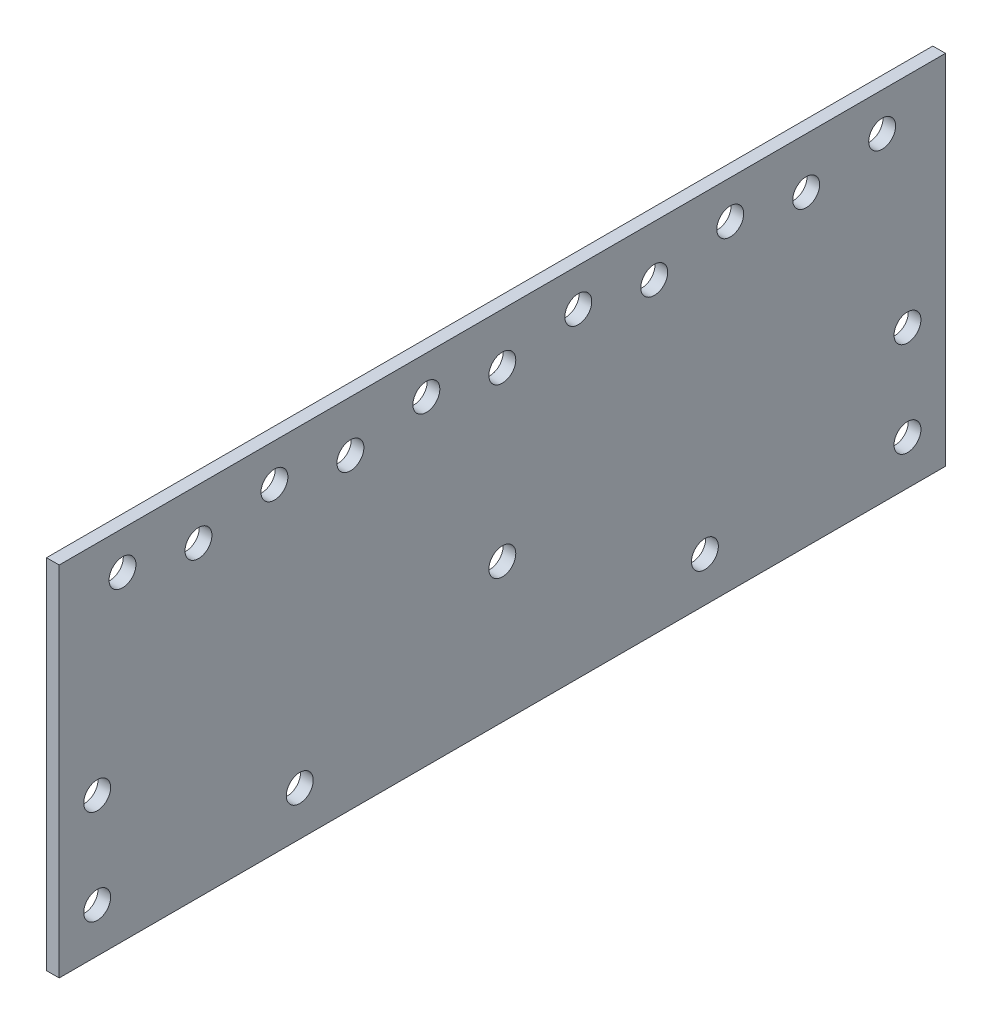
ISO-10303-21;
HEADER;
FILE_DESCRIPTION(('STEP AP214'),'2;1');
FILE_NAME('part.step','',(''),(''),'','','');
FILE_SCHEMA(('AUTOMOTIVE_DESIGN { 1 0 10303 214 1 1 1 1 }'));
ENDSEC;
DATA;
#1=APPLICATION_CONTEXT('core data for automotive mechanical design processes');
#2=APPLICATION_PROTOCOL_DEFINITION('international standard','automotive_design',2000,#1);
#3=PRODUCT_CONTEXT('',#1,'mechanical');
#4=PRODUCT('Part','Part','',(#3));
#5=PRODUCT_RELATED_PRODUCT_CATEGORY('part','',(#4));
#6=PRODUCT_DEFINITION_FORMATION('','',#4);
#7=PRODUCT_DEFINITION_CONTEXT('part definition',#1,'design');
#8=PRODUCT_DEFINITION('design','',#6,#7);
#9=PRODUCT_DEFINITION_SHAPE('','',#8);
#10=(LENGTH_UNIT() NAMED_UNIT(*) SI_UNIT(.MILLI.,.METRE.));
#11=(NAMED_UNIT(*) PLANE_ANGLE_UNIT() SI_UNIT($,.RADIAN.));
#12=(NAMED_UNIT(*) SI_UNIT($,.STERADIAN.) SOLID_ANGLE_UNIT());
#13=UNCERTAINTY_MEASURE_WITH_UNIT(LENGTH_MEASURE(1.E-05),#10,'distance_accuracy_value','');
#14=(GEOMETRIC_REPRESENTATION_CONTEXT(3) GLOBAL_UNCERTAINTY_ASSIGNED_CONTEXT((#13)) GLOBAL_UNIT_ASSIGNED_CONTEXT((#10,
#11,#12)) REPRESENTATION_CONTEXT('',''));
#15=CARTESIAN_POINT('',(0.,0.,0.));
#16=DIRECTION('',(0.,0.,1.));
#17=DIRECTION('',(1.,0.,0.));
#18=AXIS2_PLACEMENT_3D('',#15,#16,#17);
#19=CARTESIAN_POINT('',(6.35000000000013,-109.5375,222.25));
#20=DIRECTION('',(1.,0.,0.));
#21=DIRECTION('',(0.,0.,-1.));
#22=AXIS2_PLACEMENT_3D('',#19,#20,#21);
#23=PLANE('',#22);
#24=CARTESIAN_POINT('',(6.35000000000008,-39.6874999999998,-203.2));
#25=DIRECTION('',(1.,0.,0.));
#26=DIRECTION('',(0.,0.,1.));
#27=AXIS2_PLACEMENT_3D('',#24,#25,#26);
#28=CIRCLE('',#27,6.74687499999998);
#29=CARTESIAN_POINT('',(6.35000000000008,-39.6874999999998,-196.453125));
#30=VERTEX_POINT('',#29);
#31=EDGE_CURVE('E155',#30,#30,#28,.T.);
#32=ORIENTED_EDGE('',*,*,#31,.F.);
#33=EDGE_LOOP('',(#32));
#34=FACE_BOUND('',#33,.T.);
#35=CARTESIAN_POINT('',(6.35000000000008,50.8,-38.1));
#36=DIRECTION('',(1.,0.,0.));
#37=DIRECTION('',(0.,0.,1.));
#38=AXIS2_PLACEMENT_3D('',#35,#36,#37);
#39=CIRCLE('',#38,6.746875);
#40=CARTESIAN_POINT('',(6.35000000000008,50.8,-31.353125));
#41=VERTEX_POINT('',#40);
#42=EDGE_CURVE('E169',#41,#41,#39,.T.);
#43=ORIENTED_EDGE('',*,*,#42,.F.);
#44=EDGE_LOOP('',(#43));
#45=FACE_BOUND('',#44,.T.);
#46=CARTESIAN_POINT('',(6.35000000000008,50.7999999999998,-114.3));
#47=DIRECTION('',(1.,0.,0.));
#48=DIRECTION('',(0.,0.,1.));
#49=AXIS2_PLACEMENT_3D('',#46,#47,#48);
#50=CIRCLE('',#49,6.74687500000001);
#51=CARTESIAN_POINT('',(6.35000000000008,50.7999999999998,-107.553125));
#52=VERTEX_POINT('',#51);
#53=EDGE_CURVE('E179',#52,#52,#50,.T.);
#54=ORIENTED_EDGE('',*,*,#53,.F.);
#55=EDGE_LOOP('',(#54));
#56=FACE_BOUND('',#55,.T.);
#57=CARTESIAN_POINT('',(6.35000000000019,50.7999999999999,-190.5));
#58=DIRECTION('',(1.,0.,0.));
#59=DIRECTION('',(0.,0.,1.));
#60=AXIS2_PLACEMENT_3D('',#57,#58,#59);
#61=CIRCLE('',#60,6.74687499999998);
#62=CARTESIAN_POINT('',(6.35000000000019,50.7999999999999,-183.753125));
#63=VERTEX_POINT('',#62);
#64=EDGE_CURVE('E189',#63,#63,#61,.T.);
#65=ORIENTED_EDGE('',*,*,#64,.F.);
#66=EDGE_LOOP('',(#65));
#67=FACE_BOUND('',#66,.T.);
#68=CARTESIAN_POINT('',(6.34999999999986,-87.3124999999998,-203.199999999999));
#69=DIRECTION('',(1.,0.,0.));
#70=DIRECTION('',(0.,0.,1.));
#71=AXIS2_PLACEMENT_3D('',#68,#69,#70);
#72=CIRCLE('',#71,6.74687499999998);
#73=CARTESIAN_POINT('',(6.34999999999986,-87.3124999999998,-196.453124999999));
#74=VERTEX_POINT('',#73);
#75=EDGE_CURVE('E199',#74,#74,#72,.T.);
#76=ORIENTED_EDGE('',*,*,#75,.F.);
#77=EDGE_LOOP('',(#76));
#78=FACE_BOUND('',#77,.T.);
#79=CARTESIAN_POINT('',(6.3500000000003,50.7999999999996,190.5));
#80=DIRECTION('',(1.,0.,0.));
#81=DIRECTION('',(0.,0.,-1.));
#82=AXIS2_PLACEMENT_3D('',#79,#80,#81);
#83=CIRCLE('',#82,6.74687499999998);
#84=CARTESIAN_POINT('',(6.3500000000003,50.7999999999996,183.753125));
#85=VERTEX_POINT('',#84);
#86=EDGE_CURVE('E209',#85,#85,#83,.T.);
#87=ORIENTED_EDGE('',*,*,#86,.F.);
#88=EDGE_LOOP('',(#87));
#89=FACE_BOUND('',#88,.T.);
#90=CARTESIAN_POINT('',(6.35000000000008,50.7999999999999,114.3));
#91=DIRECTION('',(1.,0.,0.));
#92=DIRECTION('',(0.,0.,-1.));
#93=AXIS2_PLACEMENT_3D('',#90,#91,#92);
#94=CIRCLE('',#93,6.74687500000001);
#95=CARTESIAN_POINT('',(6.35000000000008,50.7999999999999,107.553125));
#96=VERTEX_POINT('',#95);
#97=EDGE_CURVE('E219',#96,#96,#94,.T.);
#98=ORIENTED_EDGE('',*,*,#97,.F.);
#99=EDGE_LOOP('',(#98));
#100=FACE_BOUND('',#99,.T.);
#101=CARTESIAN_POINT('',(6.35000000000019,50.7999999999997,38.1));
#102=DIRECTION('',(1.,0.,0.));
#103=DIRECTION('',(0.,0.,-1.));
#104=AXIS2_PLACEMENT_3D('',#101,#102,#103);
#105=CIRCLE('',#104,6.746875);
#106=CARTESIAN_POINT('',(6.35000000000019,50.7999999999997,31.353125));
#107=VERTEX_POINT('',#106);
#108=EDGE_CURVE('E229',#107,#107,#105,.T.);
#109=ORIENTED_EDGE('',*,*,#108,.F.);
#110=EDGE_LOOP('',(#109));
#111=FACE_BOUND('',#110,.T.);
#112=CARTESIAN_POINT('',(6.35000000000008,-87.3125000000003,203.2));
#113=DIRECTION('',(1.,0.,0.));
#114=DIRECTION('',(0.,0.,-1.));
#115=AXIS2_PLACEMENT_3D('',#112,#113,#114);
#116=CIRCLE('',#115,6.74687499999998);
#117=CARTESIAN_POINT('',(6.35000000000008,-87.3125000000003,196.453125));
#118=VERTEX_POINT('',#117);
#119=EDGE_CURVE('E89',#118,#118,#116,.T.);
#120=ORIENTED_EDGE('',*,*,#119,.F.);
#121=EDGE_LOOP('',(#120));
#122=FACE_BOUND('',#121,.T.);
#123=DIRECTION('',(0.,0.,-1.));
#124=VECTOR('',#123,1.);
#125=CARTESIAN_POINT('',(6.35000000000013,-109.5375,222.25));
#126=LINE('',#125,#124);
#127=CARTESIAN_POINT('',(6.35000000000013,-109.5375,222.25));
#128=VERTEX_POINT('',#127);
#129=CARTESIAN_POINT('',(6.35000000000008,-109.5375,-222.249999999999));
#130=VERTEX_POINT('',#129);
#131=EDGE_CURVE('E99',#128,#130,#126,.T.);
#132=ORIENTED_EDGE('',*,*,#131,.T.);
#133=DIRECTION('',(0.,1.,0.));
#134=VECTOR('',#133,1.);
#135=CARTESIAN_POINT('',(6.35000000000008,-109.5375,-222.249999999999));
#136=LINE('',#135,#134);
#137=CARTESIAN_POINT('',(6.34999999999986,69.8499999999997,-222.25));
#138=VERTEX_POINT('',#137);
#139=EDGE_CURVE('E84',#130,#138,#136,.T.);
#140=ORIENTED_EDGE('',*,*,#139,.T.);
#141=DIRECTION('',(0.,0.,1.));
#142=VECTOR('',#141,1.);
#143=CARTESIAN_POINT('',(6.35000000000008,69.8499999999998,222.25));
#144=LINE('',#143,#142);
#145=CARTESIAN_POINT('',(6.35000000000008,69.8499999999998,222.25));
#146=VERTEX_POINT('',#145);
#147=EDGE_CURVE('E50',#138,#146,#144,.T.);
#148=ORIENTED_EDGE('',*,*,#147,.T.);
#149=DIRECTION('',(0.,-1.,0.));
#150=VECTOR('',#149,1.);
#151=CARTESIAN_POINT('',(6.35000000000013,-109.5375,222.25));
#152=LINE('',#151,#150);
#153=EDGE_CURVE('E45',#146,#128,#152,.T.);
#154=ORIENTED_EDGE('',*,*,#153,.T.);
#155=EDGE_LOOP('',(#132,#140,#148,#154));
#156=FACE_BOUND('',#155,.T.);
#157=CARTESIAN_POINT('',(6.35000000000019,-87.3125,101.6));
#158=DIRECTION('',(1.,0.,0.));
#159=DIRECTION('',(0.,0.,-1.));
#160=AXIS2_PLACEMENT_3D('',#157,#158,#159);
#161=CIRCLE('',#160,6.746875);
#162=CARTESIAN_POINT('',(6.35000000000019,-87.3125,94.8531250000004));
#163=VERTEX_POINT('',#162);
#164=EDGE_CURVE('E118',#163,#163,#161,.T.);
#165=ORIENTED_EDGE('',*,*,#164,.F.);
#166=EDGE_LOOP('',(#165));
#167=FACE_BOUND('',#166,.T.);
#168=CARTESIAN_POINT('',(6.35000000000008,44.4500000000001,76.1999999999996));
#169=DIRECTION('',(1.,0.,0.));
#170=DIRECTION('',(0.,0.,-1.));
#171=AXIS2_PLACEMENT_3D('',#168,#169,#170);
#172=CIRCLE('',#171,6.74687500000001);
#173=CARTESIAN_POINT('',(6.35000000000008,44.4500000000001,69.4531249999996));
#174=VERTEX_POINT('',#173);
#175=EDGE_CURVE('E122',#174,#174,#172,.T.);
#176=ORIENTED_EDGE('',*,*,#175,.F.);
#177=EDGE_LOOP('',(#176));
#178=FACE_BOUND('',#177,.T.);
#179=CARTESIAN_POINT('',(6.35000000000008,44.4499999999998,152.4));
#180=DIRECTION('',(1.,0.,0.));
#181=DIRECTION('',(0.,0.,-1.));
#182=AXIS2_PLACEMENT_3D('',#179,#180,#181);
#183=CIRCLE('',#182,6.74687499999998);
#184=CARTESIAN_POINT('',(6.35000000000008,44.4499999999998,145.653125));
#185=VERTEX_POINT('',#184);
#186=EDGE_CURVE('E126',#185,#185,#183,.T.);
#187=ORIENTED_EDGE('',*,*,#186,.F.);
#188=EDGE_LOOP('',(#187));
#189=FACE_BOUND('',#188,.T.);
#190=CARTESIAN_POINT('',(6.35000000000052,-87.3124999999999,-101.6));
#191=DIRECTION('',(1.,0.,0.));
#192=DIRECTION('',(0.,0.,1.));
#193=AXIS2_PLACEMENT_3D('',#190,#191,#192);
#194=CIRCLE('',#193,6.746875);
#195=CARTESIAN_POINT('',(6.35000000000052,-87.3124999999999,-94.8531249999999));
#196=VERTEX_POINT('',#195);
#197=EDGE_CURVE('E130',#196,#196,#194,.T.);
#198=ORIENTED_EDGE('',*,*,#197,.F.);
#199=EDGE_LOOP('',(#198));
#200=FACE_BOUND('',#199,.T.);
#201=CARTESIAN_POINT('',(6.35000000000008,44.45,0.));
#202=DIRECTION('',(1.,0.,0.));
#203=DIRECTION('',(0.,0.,-1.));
#204=AXIS2_PLACEMENT_3D('',#201,#202,#203);
#205=CIRCLE('',#204,6.746875);
#206=CARTESIAN_POINT('',(6.35000000000008,44.45,-6.746875));
#207=VERTEX_POINT('',#206);
#208=EDGE_CURVE('E134',#207,#207,#205,.T.);
#209=ORIENTED_EDGE('',*,*,#208,.F.);
#210=EDGE_LOOP('',(#209));
#211=FACE_BOUND('',#210,.T.);
#212=CARTESIAN_POINT('',(6.34999999999997,44.4500000000001,-152.4));
#213=DIRECTION('',(1.,0.,0.));
#214=DIRECTION('',(0.,0.,1.));
#215=AXIS2_PLACEMENT_3D('',#212,#213,#214);
#216=CIRCLE('',#215,6.74687499999998);
#217=CARTESIAN_POINT('',(6.34999999999997,44.4500000000001,-145.653125));
#218=VERTEX_POINT('',#217);
#219=EDGE_CURVE('E138',#218,#218,#216,.T.);
#220=ORIENTED_EDGE('',*,*,#219,.F.);
#221=EDGE_LOOP('',(#220));
#222=FACE_BOUND('',#221,.T.);
#223=CARTESIAN_POINT('',(6.35000000000008,44.45,-76.2));
#224=DIRECTION('',(1.,0.,0.));
#225=DIRECTION('',(0.,0.,1.));
#226=AXIS2_PLACEMENT_3D('',#223,#224,#225);
#227=CIRCLE('',#226,6.74687500000001);
#228=CARTESIAN_POINT('',(6.35000000000008,44.45,-69.453125));
#229=VERTEX_POINT('',#228);
#230=EDGE_CURVE('E142',#229,#229,#227,.T.);
#231=ORIENTED_EDGE('',*,*,#230,.F.);
#232=EDGE_LOOP('',(#231));
#233=FACE_BOUND('',#232,.T.);
#234=CARTESIAN_POINT('',(6.34999999999997,-39.6875000000003,203.2));
#235=DIRECTION('',(1.,0.,0.));
#236=DIRECTION('',(0.,0.,-1.));
#237=AXIS2_PLACEMENT_3D('',#234,#235,#236);
#238=CIRCLE('',#237,6.74687499999998);
#239=CARTESIAN_POINT('',(6.34999999999997,-39.6875000000003,196.453125));
#240=VERTEX_POINT('',#239);
#241=EDGE_CURVE('E146',#240,#240,#238,.T.);
#242=ORIENTED_EDGE('',*,*,#241,.F.);
#243=EDGE_LOOP('',(#242));
#244=FACE_BOUND('',#243,.T.);
#245=CARTESIAN_POINT('',(6.34999999999997,-39.6875000000001,0.));
#246=DIRECTION('',(1.,0.,0.));
#247=DIRECTION('',(0.,0.,-1.));
#248=AXIS2_PLACEMENT_3D('',#245,#246,#247);
#249=CIRCLE('',#248,6.746875);
#250=CARTESIAN_POINT('',(6.34999999999997,-39.6875000000001,-6.746875));
#251=VERTEX_POINT('',#250);
#252=EDGE_CURVE('E149',#251,#251,#249,.T.);
#253=ORIENTED_EDGE('',*,*,#252,.F.);
#254=EDGE_LOOP('',(#253));
#255=FACE_BOUND('',#254,.T.);
#256=ADVANCED_FACE('F30',(#34,#45,#56,#67,#78,#89,#100,#111,#122,#156,#167,#178,#189,#200,#211,
#222,#233,#244,#255),#23,.T.);
#257=CARTESIAN_POINT('',(1.11022302462516E-13,-109.5375,222.25));
#258=DIRECTION('',(1.,0.,0.));
#259=DIRECTION('',(0.,0.,-1.));
#260=AXIS2_PLACEMENT_3D('',#257,#258,#259);
#261=PLANE('',#260);
#262=CARTESIAN_POINT('',(-3.33066907387547E-13,-39.6874999999996,-203.2));
#263=DIRECTION('',(1.,0.,0.));
#264=DIRECTION('',(0.,0.,1.));
#265=AXIS2_PLACEMENT_3D('',#262,#263,#264);
#266=CIRCLE('',#265,6.74687499999998);
#267=CARTESIAN_POINT('',(-3.3344143418601E-13,-39.6874999999996,-196.453125));
#268=VERTEX_POINT('',#267);
#269=EDGE_CURVE('E151',#268,#268,#266,.T.);
#270=ORIENTED_EDGE('',*,*,#269,.T.);
#271=EDGE_LOOP('',(#270));
#272=FACE_BOUND('',#271,.T.);
#273=CARTESIAN_POINT('',(-2.22044604925031E-13,50.8,-38.1));
#274=DIRECTION('',(1.,0.,0.));
#275=DIRECTION('',(0.,0.,1.));
#276=AXIS2_PLACEMENT_3D('',#273,#274,#275);
#277=CIRCLE('',#276,6.746875);
#278=CARTESIAN_POINT('',(-2.22419131723495E-13,50.8,-31.353125));
#279=VERTEX_POINT('',#278);
#280=EDGE_CURVE('E166',#279,#279,#277,.T.);
#281=ORIENTED_EDGE('',*,*,#280,.T.);
#282=EDGE_LOOP('',(#281));
#283=FACE_BOUND('',#282,.T.);
#284=CARTESIAN_POINT('',(1.11022302462516E-13,50.8000000000002,-114.300000000001));
#285=DIRECTION('',(1.,0.,0.));
#286=DIRECTION('',(0.,0.,1.));
#287=AXIS2_PLACEMENT_3D('',#284,#285,#286);
#288=CIRCLE('',#287,6.74687500000001);
#289=CARTESIAN_POINT('',(1.10647775664052E-13,50.8000000000002,-107.553125000001));
#290=VERTEX_POINT('',#289);
#291=EDGE_CURVE('E176',#290,#290,#288,.T.);
#292=ORIENTED_EDGE('',*,*,#291,.T.);
#293=EDGE_LOOP('',(#292));
#294=FACE_BOUND('',#293,.T.);
#295=CARTESIAN_POINT('',(-2.22044604925031E-13,50.7999999999999,-190.5));
#296=DIRECTION('',(1.,0.,0.));
#297=DIRECTION('',(0.,0.,1.));
#298=AXIS2_PLACEMENT_3D('',#295,#296,#297);
#299=CIRCLE('',#298,6.74687499999998);
#300=CARTESIAN_POINT('',(-2.22419131723495E-13,50.7999999999999,-183.753125));
#301=VERTEX_POINT('',#300);
#302=EDGE_CURVE('E186',#301,#301,#299,.T.);
#303=ORIENTED_EDGE('',*,*,#302,.T.);
#304=EDGE_LOOP('',(#303));
#305=FACE_BOUND('',#304,.T.);
#306=CARTESIAN_POINT('',(3.33066907387547E-13,-87.3125000000002,-203.199999999999));
#307=DIRECTION('',(1.,0.,0.));
#308=DIRECTION('',(0.,0.,1.));
#309=AXIS2_PLACEMENT_3D('',#306,#307,#308);
#310=CIRCLE('',#309,6.74687499999998);
#311=CARTESIAN_POINT('',(3.32692380589084E-13,-87.3125000000002,-196.453124999999));
#312=VERTEX_POINT('',#311);
#313=EDGE_CURVE('E196',#312,#312,#310,.T.);
#314=ORIENTED_EDGE('',*,*,#313,.T.);
#315=EDGE_LOOP('',(#314));
#316=FACE_BOUND('',#315,.T.);
#317=CARTESIAN_POINT('',(2.77555756156289E-13,50.7999999999999,190.500000000001));
#318=DIRECTION('',(1.,0.,0.));
#319=DIRECTION('',(0.,0.,-1.));
#320=AXIS2_PLACEMENT_3D('',#317,#318,#319);
#321=CIRCLE('',#320,6.74687499999998);
#322=CARTESIAN_POINT('',(2.77930282954753E-13,50.7999999999999,183.753125000001));
#323=VERTEX_POINT('',#322);
#324=EDGE_CURVE('E206',#323,#323,#321,.T.);
#325=ORIENTED_EDGE('',*,*,#324,.T.);
#326=EDGE_LOOP('',(#325));
#327=FACE_BOUND('',#326,.T.);
#328=CARTESIAN_POINT('',(-2.22044604925031E-13,50.7999999999995,114.3));
#329=DIRECTION('',(1.,0.,0.));
#330=DIRECTION('',(0.,0.,-1.));
#331=AXIS2_PLACEMENT_3D('',#328,#329,#330);
#332=CIRCLE('',#331,6.74687500000001);
#333=CARTESIAN_POINT('',(-2.21670078126568E-13,50.7999999999995,107.553125));
#334=VERTEX_POINT('',#333);
#335=EDGE_CURVE('E216',#334,#334,#332,.T.);
#336=ORIENTED_EDGE('',*,*,#335,.T.);
#337=EDGE_LOOP('',(#336));
#338=FACE_BOUND('',#337,.T.);
#339=CARTESIAN_POINT('',(1.11022302462516E-13,50.7999999999999,38.1));
#340=DIRECTION('',(1.,0.,0.));
#341=DIRECTION('',(0.,0.,-1.));
#342=AXIS2_PLACEMENT_3D('',#339,#340,#341);
#343=CIRCLE('',#342,6.746875);
#344=CARTESIAN_POINT('',(1.11396829260979E-13,50.7999999999999,31.353125));
#345=VERTEX_POINT('',#344);
#346=EDGE_CURVE('E226',#345,#345,#343,.T.);
#347=ORIENTED_EDGE('',*,*,#346,.T.);
#348=EDGE_LOOP('',(#347));
#349=FACE_BOUND('',#348,.T.);
#350=CARTESIAN_POINT('',(0.,-87.3125000000001,203.2));
#351=DIRECTION('',(1.,0.,0.));
#352=DIRECTION('',(0.,0.,-1.));
#353=AXIS2_PLACEMENT_3D('',#350,#351,#352);
#354=CIRCLE('',#353,6.74687499999998);
#355=CARTESIAN_POINT('',(0.,-87.3125000000001,196.453125));
#356=VERTEX_POINT('',#355);
#357=EDGE_CURVE('E92',#356,#356,#354,.T.);
#358=ORIENTED_EDGE('',*,*,#357,.T.);
#359=EDGE_LOOP('',(#358));
#360=FACE_BOUND('',#359,.T.);
#361=DIRECTION('',(0.,0.,-1.));
#362=VECTOR('',#361,1.);
#363=CARTESIAN_POINT('',(1.11022302462516E-13,-109.5375,222.25));
#364=LINE('',#363,#362);
#365=CARTESIAN_POINT('',(1.11022302462516E-13,-109.5375,222.25));
#366=VERTEX_POINT('',#365);
#367=CARTESIAN_POINT('',(-1.11022302462516E-13,-109.5375,-222.249999999999));
#368=VERTEX_POINT('',#367);
#369=EDGE_CURVE('E76',#366,#368,#364,.T.);
#370=ORIENTED_EDGE('',*,*,#369,.F.);
#371=DIRECTION('',(0.,-1.,0.));
#372=VECTOR('',#371,1.);
#373=CARTESIAN_POINT('',(1.11022302462516E-13,-109.5375,222.25));
#374=LINE('',#373,#372);
#375=CARTESIAN_POINT('',(1.11022302462516E-13,69.8499999999997,222.25));
#376=VERTEX_POINT('',#375);
#377=EDGE_CURVE('E97',#376,#366,#374,.T.);
#378=ORIENTED_EDGE('',*,*,#377,.F.);
#379=DIRECTION('',(0.,0.,1.));
#380=VECTOR('',#379,1.);
#381=CARTESIAN_POINT('',(1.11022302462516E-13,69.8499999999997,222.25));
#382=LINE('',#381,#380);
#383=CARTESIAN_POINT('',(-1.11022302462516E-13,69.8499999999999,-222.25));
#384=VERTEX_POINT('',#383);
#385=EDGE_CURVE('E77',#384,#376,#382,.T.);
#386=ORIENTED_EDGE('',*,*,#385,.F.);
#387=DIRECTION('',(0.,1.,0.));
#388=VECTOR('',#387,1.);
#389=CARTESIAN_POINT('',(-1.11022302462516E-13,-109.5375,-222.249999999999));
#390=LINE('',#389,#388);
#391=EDGE_CURVE('E71',#368,#384,#390,.T.);
#392=ORIENTED_EDGE('',*,*,#391,.F.);
#393=EDGE_LOOP('',(#370,#378,#386,#392));
#394=FACE_BOUND('',#393,.T.);
#395=CARTESIAN_POINT('',(0.,-87.3125,101.6));
#396=DIRECTION('',(1.,0.,0.));
#397=DIRECTION('',(0.,0.,-1.));
#398=AXIS2_PLACEMENT_3D('',#395,#396,#397);
#399=CIRCLE('',#398,6.746875);
#400=CARTESIAN_POINT('',(0.,-87.3125,94.8531250000004));
#401=VERTEX_POINT('',#400);
#402=EDGE_CURVE('E232',#401,#401,#399,.T.);
#403=ORIENTED_EDGE('',*,*,#402,.T.);
#404=EDGE_LOOP('',(#403));
#405=FACE_BOUND('',#404,.T.);
#406=CARTESIAN_POINT('',(-2.22044604925031E-13,44.4499999999999,76.2));
#407=DIRECTION('',(1.,0.,0.));
#408=DIRECTION('',(0.,0.,-1.));
#409=AXIS2_PLACEMENT_3D('',#406,#407,#408);
#410=CIRCLE('',#409,6.74687500000001);
#411=CARTESIAN_POINT('',(-2.21670078126568E-13,44.4499999999999,69.453125));
#412=VERTEX_POINT('',#411);
#413=EDGE_CURVE('E222',#412,#412,#410,.T.);
#414=ORIENTED_EDGE('',*,*,#413,.T.);
#415=EDGE_LOOP('',(#414));
#416=FACE_BOUND('',#415,.T.);
#417=CARTESIAN_POINT('',(0.,44.45,152.4));
#418=DIRECTION('',(1.,0.,0.));
#419=DIRECTION('',(0.,0.,-1.));
#420=AXIS2_PLACEMENT_3D('',#417,#418,#419);
#421=CIRCLE('',#420,6.74687499999998);
#422=CARTESIAN_POINT('',(0.,44.45,145.653125));
#423=VERTEX_POINT('',#422);
#424=EDGE_CURVE('E212',#423,#423,#421,.T.);
#425=ORIENTED_EDGE('',*,*,#424,.T.);
#426=EDGE_LOOP('',(#425));
#427=FACE_BOUND('',#426,.T.);
#428=CARTESIAN_POINT('',(2.22044604925031E-13,-87.3124999999999,-101.599999999999));
#429=DIRECTION('',(1.,0.,0.));
#430=DIRECTION('',(0.,0.,1.));
#431=AXIS2_PLACEMENT_3D('',#428,#429,#430);
#432=CIRCLE('',#431,6.746875);
#433=CARTESIAN_POINT('',(2.21670078126568E-13,-87.3124999999999,-94.8531249999995));
#434=VERTEX_POINT('',#433);
#435=EDGE_CURVE('E202',#434,#434,#432,.T.);
#436=ORIENTED_EDGE('',*,*,#435,.T.);
#437=EDGE_LOOP('',(#436));
#438=FACE_BOUND('',#437,.T.);
#439=CARTESIAN_POINT('',(2.22044604925031E-13,44.45,-4.44089209850063E-13));
#440=DIRECTION('',(1.,0.,0.));
#441=DIRECTION('',(0.,0.,-1.));
#442=AXIS2_PLACEMENT_3D('',#439,#440,#441);
#443=CIRCLE('',#442,6.746875);
#444=CARTESIAN_POINT('',(2.22419131723495E-13,44.45,-6.74687500000044));
#445=VERTEX_POINT('',#444);
#446=EDGE_CURVE('E192',#445,#445,#443,.T.);
#447=ORIENTED_EDGE('',*,*,#446,.T.);
#448=EDGE_LOOP('',(#447));
#449=FACE_BOUND('',#448,.T.);
#450=CARTESIAN_POINT('',(0.,44.4500000000002,-152.4));
#451=DIRECTION('',(1.,0.,0.));
#452=DIRECTION('',(0.,0.,1.));
#453=AXIS2_PLACEMENT_3D('',#450,#451,#452);
#454=CIRCLE('',#453,6.74687499999998);
#455=CARTESIAN_POINT('',(0.,44.4500000000002,-145.653125));
#456=VERTEX_POINT('',#455);
#457=EDGE_CURVE('E182',#456,#456,#454,.T.);
#458=ORIENTED_EDGE('',*,*,#457,.T.);
#459=EDGE_LOOP('',(#458));
#460=FACE_BOUND('',#459,.T.);
#461=CARTESIAN_POINT('',(1.11022302462516E-13,44.4499999999999,-76.2000000000005));
#462=DIRECTION('',(1.,0.,0.));
#463=DIRECTION('',(0.,0.,1.));
#464=AXIS2_PLACEMENT_3D('',#461,#462,#463);
#465=CIRCLE('',#464,6.74687500000001);
#466=CARTESIAN_POINT('',(1.10647775664052E-13,44.4499999999999,-69.4531250000005));
#467=VERTEX_POINT('',#466);
#468=EDGE_CURVE('E172',#467,#467,#465,.T.);
#469=ORIENTED_EDGE('',*,*,#468,.T.);
#470=EDGE_LOOP('',(#469));
#471=FACE_BOUND('',#470,.T.);
#472=CARTESIAN_POINT('',(1.11022302462516E-13,-39.6875000000003,203.2));
#473=DIRECTION('',(1.,0.,0.));
#474=DIRECTION('',(0.,0.,-1.));
#475=AXIS2_PLACEMENT_3D('',#472,#473,#474);
#476=CIRCLE('',#475,6.74687499999998);
#477=CARTESIAN_POINT('',(1.11396829260979E-13,-39.6875000000003,196.453125));
#478=VERTEX_POINT('',#477);
#479=EDGE_CURVE('E162',#478,#478,#476,.T.);
#480=ORIENTED_EDGE('',*,*,#479,.T.);
#481=EDGE_LOOP('',(#480));
#482=FACE_BOUND('',#481,.T.);
#483=CARTESIAN_POINT('',(1.11022302462516E-13,-39.6875000000001,0.));
#484=DIRECTION('',(1.,0.,0.));
#485=DIRECTION('',(0.,0.,-1.));
#486=AXIS2_PLACEMENT_3D('',#483,#484,#485);
#487=CIRCLE('',#486,6.746875);
#488=CARTESIAN_POINT('',(1.11396829260979E-13,-39.6875000000001,-6.746875));
#489=VERTEX_POINT('',#488);
#490=EDGE_CURVE('E152',#489,#489,#487,.T.);
#491=ORIENTED_EDGE('',*,*,#490,.T.);
#492=EDGE_LOOP('',(#491));
#493=FACE_BOUND('',#492,.T.);
#494=ADVANCED_FACE('F72',(#272,#283,#294,#305,#316,#327,#338,#349,#360,#394,#405,#416,#427,#438,
#449,#460,#471,#482,#493),#261,.F.);
#495=CARTESIAN_POINT('',(6.35000000000013,-109.5375,222.25));
#496=DIRECTION('',(0.,1.,0.));
#497=DIRECTION('',(0.,0.,1.));
#498=AXIS2_PLACEMENT_3D('',#495,#496,#497);
#499=PLANE('',#498);
#500=ORIENTED_EDGE('',*,*,#369,.T.);
#501=DIRECTION('',(-1.,0.,0.));
#502=VECTOR('',#501,1.);
#503=CARTESIAN_POINT('',(6.35000000000008,-109.5375,-222.249999999999));
#504=LINE('',#503,#502);
#505=EDGE_CURVE('E11',#130,#368,#504,.T.);
#506=ORIENTED_EDGE('',*,*,#505,.F.);
#507=ORIENTED_EDGE('',*,*,#131,.F.);
#508=DIRECTION('',(-1.,0.,0.));
#509=VECTOR('',#508,1.);
#510=CARTESIAN_POINT('',(6.35000000000013,-109.5375,222.25));
#511=LINE('',#510,#509);
#512=EDGE_CURVE('E88',#128,#366,#511,.T.);
#513=ORIENTED_EDGE('',*,*,#512,.T.);
#514=EDGE_LOOP('',(#500,#506,#507,#513));
#515=FACE_BOUND('',#514,.T.);
#516=ADVANCED_FACE('F32',(#515),#499,.F.);
#517=CARTESIAN_POINT('',(6.35000000000008,-109.5375,-222.249999999999));
#518=DIRECTION('',(0.,0.,1.));
#519=DIRECTION('',(0.,-1.,0.));
#520=AXIS2_PLACEMENT_3D('',#517,#518,#519);
#521=PLANE('',#520);
#522=ORIENTED_EDGE('',*,*,#391,.T.);
#523=DIRECTION('',(-1.,0.,0.));
#524=VECTOR('',#523,1.);
#525=CARTESIAN_POINT('',(6.34999999999986,69.8499999999997,-222.25));
#526=LINE('',#525,#524);
#527=EDGE_CURVE('E38',#138,#384,#526,.T.);
#528=ORIENTED_EDGE('',*,*,#527,.F.);
#529=ORIENTED_EDGE('',*,*,#139,.F.);
#530=ORIENTED_EDGE('',*,*,#505,.T.);
#531=EDGE_LOOP('',(#522,#528,#529,#530));
#532=FACE_BOUND('',#531,.T.);
#533=ADVANCED_FACE('F83',(#532),#521,.F.);
#534=CARTESIAN_POINT('',(6.35000000000008,69.8499999999998,222.25));
#535=DIRECTION('',(0.,-1.,0.));
#536=DIRECTION('',(0.,0.,-1.));
#537=AXIS2_PLACEMENT_3D('',#534,#535,#536);
#538=PLANE('',#537);
#539=ORIENTED_EDGE('',*,*,#385,.T.);
#540=DIRECTION('',(-1.,0.,0.));
#541=VECTOR('',#540,1.);
#542=CARTESIAN_POINT('',(6.35000000000008,69.8499999999998,222.25));
#543=LINE('',#542,#541);
#544=EDGE_CURVE('E105',#146,#376,#543,.T.);
#545=ORIENTED_EDGE('',*,*,#544,.F.);
#546=ORIENTED_EDGE('',*,*,#147,.F.);
#547=ORIENTED_EDGE('',*,*,#527,.T.);
#548=EDGE_LOOP('',(#539,#545,#546,#547));
#549=FACE_BOUND('',#548,.T.);
#550=ADVANCED_FACE('F108',(#549),#538,.F.);
#551=CARTESIAN_POINT('',(6.35000000000013,-109.5375,222.25));
#552=DIRECTION('',(0.,0.,-1.));
#553=DIRECTION('',(-1.,0.,0.));
#554=AXIS2_PLACEMENT_3D('',#551,#552,#553);
#555=PLANE('',#554);
#556=ORIENTED_EDGE('',*,*,#377,.T.);
#557=ORIENTED_EDGE('',*,*,#512,.F.);
#558=ORIENTED_EDGE('',*,*,#153,.F.);
#559=ORIENTED_EDGE('',*,*,#544,.T.);
#560=EDGE_LOOP('',(#556,#557,#558,#559));
#561=FACE_BOUND('',#560,.T.);
#562=ADVANCED_FACE('F110',(#561),#555,.F.);
#563=CARTESIAN_POINT('',(6.35000000000008,-87.3125000000003,203.2));
#564=DIRECTION('',(-1.,0.,0.));
#565=DIRECTION('',(0.,0.,1.));
#566=AXIS2_PLACEMENT_3D('',#563,#564,#565);
#567=CYLINDRICAL_SURFACE('',#566,6.74687499999998);
#568=ORIENTED_EDGE('',*,*,#119,.T.);
#569=EDGE_LOOP('',(#568));
#570=FACE_BOUND('',#569,.T.);
#571=ORIENTED_EDGE('',*,*,#357,.F.);
#572=EDGE_LOOP('',(#571));
#573=FACE_BOUND('',#572,.T.);
#574=ADVANCED_FACE('F239',(#570,#573),#567,.F.);
#575=CARTESIAN_POINT('',(6.35000000000019,-87.3125,101.6));
#576=DIRECTION('',(-1.,0.,0.));
#577=DIRECTION('',(0.,0.,1.));
#578=AXIS2_PLACEMENT_3D('',#575,#576,#577);
#579=CYLINDRICAL_SURFACE('',#578,6.746875);
#580=ORIENTED_EDGE('',*,*,#164,.T.);
#581=EDGE_LOOP('',(#580));
#582=FACE_BOUND('',#581,.T.);
#583=ORIENTED_EDGE('',*,*,#402,.F.);
#584=EDGE_LOOP('',(#583));
#585=FACE_BOUND('',#584,.T.);
#586=ADVANCED_FACE('F241',(#582,#585),#579,.F.);
#587=CARTESIAN_POINT('',(6.35000000000019,50.7999999999997,38.1));
#588=DIRECTION('',(-1.,0.,0.));
#589=DIRECTION('',(0.,0.,1.));
#590=AXIS2_PLACEMENT_3D('',#587,#588,#589);
#591=CYLINDRICAL_SURFACE('',#590,6.746875);
#592=ORIENTED_EDGE('',*,*,#108,.T.);
#593=EDGE_LOOP('',(#592));
#594=FACE_BOUND('',#593,.T.);
#595=ORIENTED_EDGE('',*,*,#346,.F.);
#596=EDGE_LOOP('',(#595));
#597=FACE_BOUND('',#596,.T.);
#598=ADVANCED_FACE('F248',(#594,#597),#591,.F.);
#599=CARTESIAN_POINT('',(6.35000000000008,44.4500000000001,76.1999999999996));
#600=DIRECTION('',(-1.,0.,0.));
#601=DIRECTION('',(0.,0.,1.));
#602=AXIS2_PLACEMENT_3D('',#599,#600,#601);
#603=CYLINDRICAL_SURFACE('',#602,6.74687500000001);
#604=ORIENTED_EDGE('',*,*,#175,.T.);
#605=EDGE_LOOP('',(#604));
#606=FACE_BOUND('',#605,.T.);
#607=ORIENTED_EDGE('',*,*,#413,.F.);
#608=EDGE_LOOP('',(#607));
#609=FACE_BOUND('',#608,.T.);
#610=ADVANCED_FACE('F303',(#606,#609),#603,.F.);
#611=CARTESIAN_POINT('',(6.35000000000008,50.7999999999999,114.3));
#612=DIRECTION('',(-1.,0.,0.));
#613=DIRECTION('',(0.,0.,1.));
#614=AXIS2_PLACEMENT_3D('',#611,#612,#613);
#615=CYLINDRICAL_SURFACE('',#614,6.74687500000001);
#616=ORIENTED_EDGE('',*,*,#97,.T.);
#617=EDGE_LOOP('',(#616));
#618=FACE_BOUND('',#617,.T.);
#619=ORIENTED_EDGE('',*,*,#335,.F.);
#620=EDGE_LOOP('',(#619));
#621=FACE_BOUND('',#620,.T.);
#622=ADVANCED_FACE('F313',(#618,#621),#615,.F.);
#623=CARTESIAN_POINT('',(6.35000000000008,44.4499999999998,152.4));
#624=DIRECTION('',(-1.,0.,0.));
#625=DIRECTION('',(0.,0.,1.));
#626=AXIS2_PLACEMENT_3D('',#623,#624,#625);
#627=CYLINDRICAL_SURFACE('',#626,6.74687499999998);
#628=ORIENTED_EDGE('',*,*,#186,.T.);
#629=EDGE_LOOP('',(#628));
#630=FACE_BOUND('',#629,.T.);
#631=ORIENTED_EDGE('',*,*,#424,.F.);
#632=EDGE_LOOP('',(#631));
#633=FACE_BOUND('',#632,.T.);
#634=ADVANCED_FACE('F324',(#630,#633),#627,.F.);
#635=CARTESIAN_POINT('',(6.3500000000003,50.7999999999996,190.5));
#636=DIRECTION('',(-1.,0.,0.));
#637=DIRECTION('',(0.,0.,1.));
#638=AXIS2_PLACEMENT_3D('',#635,#636,#637);
#639=CYLINDRICAL_SURFACE('',#638,6.74687499999998);
#640=ORIENTED_EDGE('',*,*,#86,.T.);
#641=EDGE_LOOP('',(#640));
#642=FACE_BOUND('',#641,.T.);
#643=ORIENTED_EDGE('',*,*,#324,.F.);
#644=EDGE_LOOP('',(#643));
#645=FACE_BOUND('',#644,.T.);
#646=ADVANCED_FACE('F335',(#642,#645),#639,.F.);
#647=CARTESIAN_POINT('',(6.35000000000052,-87.3124999999999,-101.6));
#648=DIRECTION('',(-1.,0.,0.));
#649=DIRECTION('',(0.,0.,1.));
#650=AXIS2_PLACEMENT_3D('',#647,#648,#649);
#651=CYLINDRICAL_SURFACE('',#650,6.746875);
#652=ORIENTED_EDGE('',*,*,#197,.T.);
#653=EDGE_LOOP('',(#652));
#654=FACE_BOUND('',#653,.T.);
#655=ORIENTED_EDGE('',*,*,#435,.F.);
#656=EDGE_LOOP('',(#655));
#657=FACE_BOUND('',#656,.T.);
#658=ADVANCED_FACE('F346',(#654,#657),#651,.F.);
#659=CARTESIAN_POINT('',(6.34999999999986,-87.3124999999998,-203.199999999999));
#660=DIRECTION('',(-1.,0.,0.));
#661=DIRECTION('',(0.,0.,1.));
#662=AXIS2_PLACEMENT_3D('',#659,#660,#661);
#663=CYLINDRICAL_SURFACE('',#662,6.74687499999998);
#664=ORIENTED_EDGE('',*,*,#75,.T.);
#665=EDGE_LOOP('',(#664));
#666=FACE_BOUND('',#665,.T.);
#667=ORIENTED_EDGE('',*,*,#313,.F.);
#668=EDGE_LOOP('',(#667));
#669=FACE_BOUND('',#668,.T.);
#670=ADVANCED_FACE('F357',(#666,#669),#663,.F.);
#671=CARTESIAN_POINT('',(6.35000000000008,44.45,0.));
#672=DIRECTION('',(-1.,0.,0.));
#673=DIRECTION('',(0.,0.,1.));
#674=AXIS2_PLACEMENT_3D('',#671,#672,#673);
#675=CYLINDRICAL_SURFACE('',#674,6.746875);
#676=ORIENTED_EDGE('',*,*,#208,.T.);
#677=EDGE_LOOP('',(#676));
#678=FACE_BOUND('',#677,.T.);
#679=ORIENTED_EDGE('',*,*,#446,.F.);
#680=EDGE_LOOP('',(#679));
#681=FACE_BOUND('',#680,.T.);
#682=ADVANCED_FACE('F368',(#678,#681),#675,.F.);
#683=CARTESIAN_POINT('',(6.35000000000019,50.7999999999999,-190.5));
#684=DIRECTION('',(-1.,0.,0.));
#685=DIRECTION('',(0.,0.,1.));
#686=AXIS2_PLACEMENT_3D('',#683,#684,#685);
#687=CYLINDRICAL_SURFACE('',#686,6.74687499999998);
#688=ORIENTED_EDGE('',*,*,#64,.T.);
#689=EDGE_LOOP('',(#688));
#690=FACE_BOUND('',#689,.T.);
#691=ORIENTED_EDGE('',*,*,#302,.F.);
#692=EDGE_LOOP('',(#691));
#693=FACE_BOUND('',#692,.T.);
#694=ADVANCED_FACE('F379',(#690,#693),#687,.F.);
#695=CARTESIAN_POINT('',(6.34999999999997,44.4500000000001,-152.4));
#696=DIRECTION('',(-1.,0.,0.));
#697=DIRECTION('',(0.,0.,1.));
#698=AXIS2_PLACEMENT_3D('',#695,#696,#697);
#699=CYLINDRICAL_SURFACE('',#698,6.74687499999998);
#700=ORIENTED_EDGE('',*,*,#219,.T.);
#701=EDGE_LOOP('',(#700));
#702=FACE_BOUND('',#701,.T.);
#703=ORIENTED_EDGE('',*,*,#457,.F.);
#704=EDGE_LOOP('',(#703));
#705=FACE_BOUND('',#704,.T.);
#706=ADVANCED_FACE('F390',(#702,#705),#699,.F.);
#707=CARTESIAN_POINT('',(6.35000000000008,50.7999999999998,-114.3));
#708=DIRECTION('',(-1.,0.,0.));
#709=DIRECTION('',(0.,0.,1.));
#710=AXIS2_PLACEMENT_3D('',#707,#708,#709);
#711=CYLINDRICAL_SURFACE('',#710,6.74687500000001);
#712=ORIENTED_EDGE('',*,*,#53,.T.);
#713=EDGE_LOOP('',(#712));
#714=FACE_BOUND('',#713,.T.);
#715=ORIENTED_EDGE('',*,*,#291,.F.);
#716=EDGE_LOOP('',(#715));
#717=FACE_BOUND('',#716,.T.);
#718=ADVANCED_FACE('F401',(#714,#717),#711,.F.);
#719=CARTESIAN_POINT('',(6.35000000000008,44.45,-76.2));
#720=DIRECTION('',(-1.,0.,0.));
#721=DIRECTION('',(0.,0.,1.));
#722=AXIS2_PLACEMENT_3D('',#719,#720,#721);
#723=CYLINDRICAL_SURFACE('',#722,6.74687500000001);
#724=ORIENTED_EDGE('',*,*,#230,.T.);
#725=EDGE_LOOP('',(#724));
#726=FACE_BOUND('',#725,.T.);
#727=ORIENTED_EDGE('',*,*,#468,.F.);
#728=EDGE_LOOP('',(#727));
#729=FACE_BOUND('',#728,.T.);
#730=ADVANCED_FACE('F412',(#726,#729),#723,.F.);
#731=CARTESIAN_POINT('',(6.35000000000008,50.8,-38.1));
#732=DIRECTION('',(-1.,0.,0.));
#733=DIRECTION('',(0.,0.,1.));
#734=AXIS2_PLACEMENT_3D('',#731,#732,#733);
#735=CYLINDRICAL_SURFACE('',#734,6.746875);
#736=ORIENTED_EDGE('',*,*,#42,.T.);
#737=EDGE_LOOP('',(#736));
#738=FACE_BOUND('',#737,.T.);
#739=ORIENTED_EDGE('',*,*,#280,.F.);
#740=EDGE_LOOP('',(#739));
#741=FACE_BOUND('',#740,.T.);
#742=ADVANCED_FACE('F423',(#738,#741),#735,.F.);
#743=CARTESIAN_POINT('',(6.34999999999997,-39.6875000000003,203.2));
#744=DIRECTION('',(-1.,0.,0.));
#745=DIRECTION('',(0.,0.,1.));
#746=AXIS2_PLACEMENT_3D('',#743,#744,#745);
#747=CYLINDRICAL_SURFACE('',#746,6.74687499999998);
#748=ORIENTED_EDGE('',*,*,#241,.T.);
#749=EDGE_LOOP('',(#748));
#750=FACE_BOUND('',#749,.T.);
#751=ORIENTED_EDGE('',*,*,#479,.F.);
#752=EDGE_LOOP('',(#751));
#753=FACE_BOUND('',#752,.T.);
#754=ADVANCED_FACE('F434',(#750,#753),#747,.F.);
#755=CARTESIAN_POINT('',(6.35000000000008,-39.6874999999998,-203.2));
#756=DIRECTION('',(-1.,0.,0.));
#757=DIRECTION('',(0.,0.,1.));
#758=AXIS2_PLACEMENT_3D('',#755,#756,#757);
#759=CYLINDRICAL_SURFACE('',#758,6.74687499999998);
#760=ORIENTED_EDGE('',*,*,#31,.T.);
#761=EDGE_LOOP('',(#760));
#762=FACE_BOUND('',#761,.T.);
#763=ORIENTED_EDGE('',*,*,#269,.F.);
#764=EDGE_LOOP('',(#763));
#765=FACE_BOUND('',#764,.T.);
#766=ADVANCED_FACE('F445',(#762,#765),#759,.F.);
#767=CARTESIAN_POINT('',(6.34999999999997,-39.6875000000001,0.));
#768=DIRECTION('',(-1.,0.,0.));
#769=DIRECTION('',(0.,0.,1.));
#770=AXIS2_PLACEMENT_3D('',#767,#768,#769);
#771=CYLINDRICAL_SURFACE('',#770,6.746875);
#772=ORIENTED_EDGE('',*,*,#252,.T.);
#773=EDGE_LOOP('',(#772));
#774=FACE_BOUND('',#773,.T.);
#775=ORIENTED_EDGE('',*,*,#490,.F.);
#776=EDGE_LOOP('',(#775));
#777=FACE_BOUND('',#776,.T.);
#778=ADVANCED_FACE('F456',(#774,#777),#771,.F.);
#779=CLOSED_SHELL('',(#256,#494,#516,#533,#550,#562,#574,#586,#598,#610,#622,#634,#646,#658,
#670,#682,#694,#706,#718,#730,#742,#754,#766,#778));
#780=MANIFOLD_SOLID_BREP('B2',#779);
#781=ADVANCED_BREP_SHAPE_REPRESENTATION('',(#18,#780),#14);
#782=SHAPE_DEFINITION_REPRESENTATION(#9,#781);
ENDSEC;
END-ISO-10303-21;
